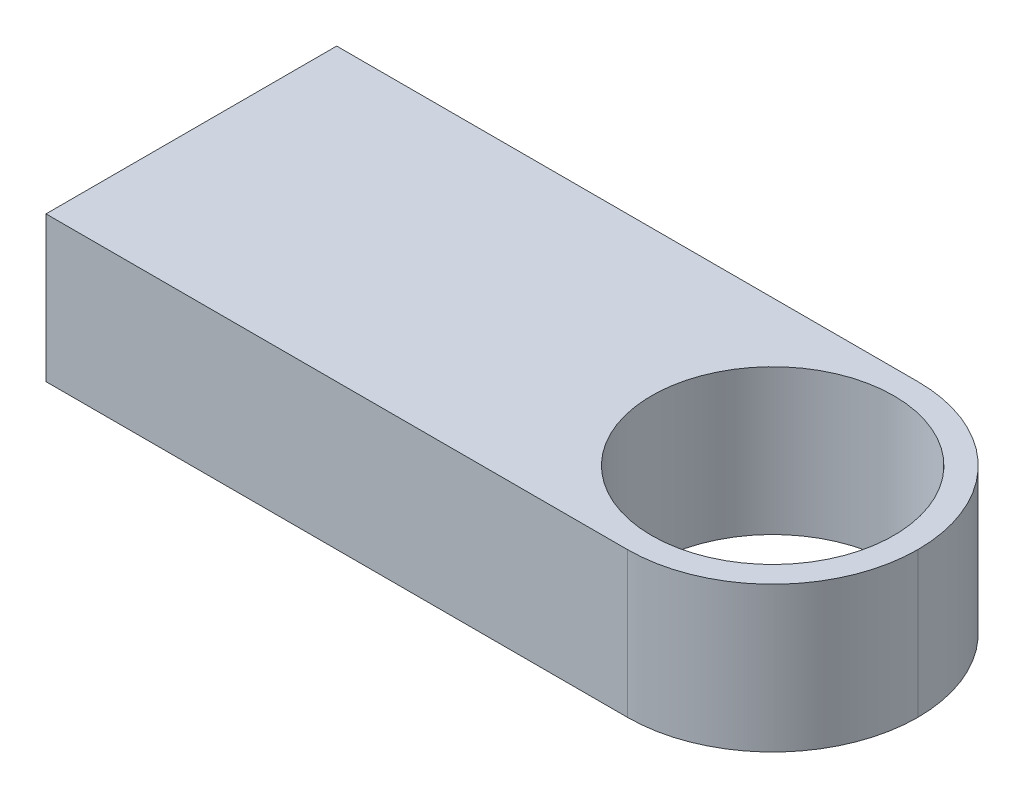
ISO-10303-21;
HEADER;
FILE_DESCRIPTION(('STEP AP214'),'2;1');
FILE_NAME('part.step','',(''),(''),'','','');
FILE_SCHEMA(('AUTOMOTIVE_DESIGN { 1 0 10303 214 1 1 1 1 }'));
ENDSEC;
DATA;
#1=APPLICATION_CONTEXT('core data for automotive mechanical design processes');
#2=APPLICATION_PROTOCOL_DEFINITION('international standard','automotive_design',2000,#1);
#3=PRODUCT_CONTEXT('',#1,'mechanical');
#4=PRODUCT('Part','Part','',(#3));
#5=PRODUCT_RELATED_PRODUCT_CATEGORY('part','',(#4));
#6=PRODUCT_DEFINITION_FORMATION('','',#4);
#7=PRODUCT_DEFINITION_CONTEXT('part definition',#1,'design');
#8=PRODUCT_DEFINITION('design','',#6,#7);
#9=PRODUCT_DEFINITION_SHAPE('','',#8);
#10=(LENGTH_UNIT() NAMED_UNIT(*) SI_UNIT(.MILLI.,.METRE.));
#11=(NAMED_UNIT(*) PLANE_ANGLE_UNIT() SI_UNIT($,.RADIAN.));
#12=(NAMED_UNIT(*) SI_UNIT($,.STERADIAN.) SOLID_ANGLE_UNIT());
#13=UNCERTAINTY_MEASURE_WITH_UNIT(LENGTH_MEASURE(1.E-05),#10,'distance_accuracy_value','');
#14=(GEOMETRIC_REPRESENTATION_CONTEXT(3) GLOBAL_UNCERTAINTY_ASSIGNED_CONTEXT((#13)) GLOBAL_UNIT_ASSIGNED_CONTEXT((#10,
#11,#12)) REPRESENTATION_CONTEXT('',''));
#15=CARTESIAN_POINT('',(0.,0.,0.));
#16=DIRECTION('',(0.,0.,1.));
#17=DIRECTION('',(1.,0.,0.));
#18=AXIS2_PLACEMENT_3D('',#15,#16,#17);
#19=CARTESIAN_POINT('',(150.,15.,-30.));
#20=DIRECTION('',(0.,0.,1.));
#21=DIRECTION('',(0.,-1.,0.));
#22=AXIS2_PLACEMENT_3D('',#19,#20,#21);
#23=PLANE('',#22);
#24=DIRECTION('',(-1.,0.,0.));
#25=VECTOR('',#24,1.);
#26=CARTESIAN_POINT('',(150.,15.,-30.));
#27=LINE('',#26,#25);
#28=CARTESIAN_POINT('',(120.,15.,-30.));
#29=VERTEX_POINT('',#28);
#30=CARTESIAN_POINT('',(0.,15.,-30.));
#31=VERTEX_POINT('',#30);
#32=EDGE_CURVE('E80',#29,#31,#27,.T.);
#33=ORIENTED_EDGE('',*,*,#32,.F.);
#34=DIRECTION('',(0.,1.,0.));
#35=VECTOR('',#34,1.);
#36=CARTESIAN_POINT('',(120.,-15.,-30.));
#37=LINE('',#36,#35);
#38=CARTESIAN_POINT('',(120.,-15.,-30.));
#39=VERTEX_POINT('',#38);
#40=EDGE_CURVE('E121',#29,#39,#37,.F.);
#41=ORIENTED_EDGE('',*,*,#40,.T.);
#42=DIRECTION('',(-1.,0.,0.));
#43=VECTOR('',#42,1.);
#44=CARTESIAN_POINT('',(150.,-15.,-30.));
#45=LINE('',#44,#43);
#46=CARTESIAN_POINT('',(0.,-15.,-30.));
#47=VERTEX_POINT('',#46);
#48=EDGE_CURVE('E103',#39,#47,#45,.T.);
#49=ORIENTED_EDGE('',*,*,#48,.T.);
#50=DIRECTION('',(0.,1.,0.));
#51=VECTOR('',#50,1.);
#52=CARTESIAN_POINT('',(0.,15.,-30.));
#53=LINE('',#52,#51);
#54=EDGE_CURVE('E99',#47,#31,#53,.T.);
#55=ORIENTED_EDGE('',*,*,#54,.T.);
#56=EDGE_LOOP('',(#33,#41,#49,#55));
#57=FACE_BOUND('',#56,.T.);
#58=ADVANCED_FACE('F36',(#57),#23,.F.);
#59=CARTESIAN_POINT('',(150.,15.,30.));
#60=DIRECTION('',(0.,-1.,0.));
#61=DIRECTION('',(0.,0.,-1.));
#62=AXIS2_PLACEMENT_3D('',#59,#60,#61);
#63=PLANE('',#62);
#64=CARTESIAN_POINT('',(120.,15.,0.));
#65=DIRECTION('',(0.,1.,0.));
#66=DIRECTION('',(0.,0.,1.));
#67=AXIS2_PLACEMENT_3D('',#64,#65,#66);
#68=CIRCLE('',#67,25.);
#69=CARTESIAN_POINT('',(120.,15.,25.));
#70=VERTEX_POINT('',#69);
#71=EDGE_CURVE('E108',#70,#70,#68,.T.);
#72=ORIENTED_EDGE('',*,*,#71,.F.);
#73=EDGE_LOOP('',(#72));
#74=FACE_BOUND('',#73,.T.);
#75=CARTESIAN_POINT('',(120.,15.,0.));
#76=DIRECTION('',(0.,-1.,0.));
#77=DIRECTION('',(0.,0.,-1.));
#78=AXIS2_PLACEMENT_3D('',#75,#76,#77);
#79=CIRCLE('',#78,30.);
#80=CARTESIAN_POINT('',(120.,15.,30.));
#81=VERTEX_POINT('',#80);
#82=CARTESIAN_POINT('',(150.,15.,0.));
#83=VERTEX_POINT('',#82);
#84=EDGE_CURVE('E92',#81,#83,#79,.F.);
#85=ORIENTED_EDGE('',*,*,#84,.T.);
#86=CARTESIAN_POINT('',(120.,15.,0.));
#87=DIRECTION('',(0.,-1.,0.));
#88=DIRECTION('',(0.,0.,-1.));
#89=AXIS2_PLACEMENT_3D('',#86,#87,#88);
#90=CIRCLE('',#89,30.);
#91=EDGE_CURVE('E87',#83,#29,#90,.F.);
#92=ORIENTED_EDGE('',*,*,#91,.T.);
#93=ORIENTED_EDGE('',*,*,#32,.T.);
#94=DIRECTION('',(0.,0.,1.));
#95=VECTOR('',#94,1.);
#96=CARTESIAN_POINT('',(0.,15.,30.));
#97=LINE('',#96,#95);
#98=CARTESIAN_POINT('',(0.,15.,30.));
#99=VERTEX_POINT('',#98);
#100=EDGE_CURVE('E84',#31,#99,#97,.T.);
#101=ORIENTED_EDGE('',*,*,#100,.T.);
#102=DIRECTION('',(-1.,0.,0.));
#103=VECTOR('',#102,1.);
#104=CARTESIAN_POINT('',(150.,15.,30.));
#105=LINE('',#104,#103);
#106=EDGE_CURVE('E93',#81,#99,#105,.T.);
#107=ORIENTED_EDGE('',*,*,#106,.F.);
#108=EDGE_LOOP('',(#85,#92,#93,#101,#107));
#109=FACE_BOUND('',#108,.T.);
#110=ADVANCED_FACE('F82',(#74,#109),#63,.F.);
#111=CARTESIAN_POINT('',(150.,15.,30.));
#112=DIRECTION('',(0.,0.,-1.));
#113=DIRECTION('',(0.,1.,0.));
#114=AXIS2_PLACEMENT_3D('',#111,#112,#113);
#115=PLANE('',#114);
#116=DIRECTION('',(-1.,0.,0.));
#117=VECTOR('',#116,1.);
#118=CARTESIAN_POINT('',(150.,-15.,30.));
#119=LINE('',#118,#117);
#120=CARTESIAN_POINT('',(120.,-15.,30.));
#121=VERTEX_POINT('',#120);
#122=CARTESIAN_POINT('',(0.,-15.,30.));
#123=VERTEX_POINT('',#122);
#124=EDGE_CURVE('E116',#121,#123,#119,.T.);
#125=ORIENTED_EDGE('',*,*,#124,.F.);
#126=DIRECTION('',(0.,-1.,0.));
#127=VECTOR('',#126,1.);
#128=CARTESIAN_POINT('',(120.,15.,30.));
#129=LINE('',#128,#127);
#130=EDGE_CURVE('E11',#121,#81,#129,.F.);
#131=ORIENTED_EDGE('',*,*,#130,.T.);
#132=ORIENTED_EDGE('',*,*,#106,.T.);
#133=DIRECTION('',(0.,-1.,0.));
#134=VECTOR('',#133,1.);
#135=CARTESIAN_POINT('',(0.,15.,30.));
#136=LINE('',#135,#134);
#137=EDGE_CURVE('E101',#99,#123,#136,.T.);
#138=ORIENTED_EDGE('',*,*,#137,.T.);
#139=EDGE_LOOP('',(#125,#131,#132,#138));
#140=FACE_BOUND('',#139,.T.);
#141=ADVANCED_FACE('F128',(#140),#115,.F.);
#142=CARTESIAN_POINT('',(150.,-15.,30.));
#143=DIRECTION('',(0.,1.,0.));
#144=DIRECTION('',(0.,0.,1.));
#145=AXIS2_PLACEMENT_3D('',#142,#143,#144);
#146=PLANE('',#145);
#147=CARTESIAN_POINT('',(120.,-15.,0.));
#148=DIRECTION('',(0.,1.,0.));
#149=DIRECTION('',(0.,0.,1.));
#150=AXIS2_PLACEMENT_3D('',#147,#148,#149);
#151=CIRCLE('',#150,25.);
#152=CARTESIAN_POINT('',(120.,-15.,25.));
#153=VERTEX_POINT('',#152);
#154=EDGE_CURVE('E105',#153,#153,#151,.F.);
#155=ORIENTED_EDGE('',*,*,#154,.F.);
#156=EDGE_LOOP('',(#155));
#157=FACE_BOUND('',#156,.T.);
#158=ORIENTED_EDGE('',*,*,#48,.F.);
#159=CARTESIAN_POINT('',(120.,-15.,0.));
#160=DIRECTION('',(0.,1.,0.));
#161=DIRECTION('',(0.,0.,1.));
#162=AXIS2_PLACEMENT_3D('',#159,#160,#161);
#163=CIRCLE('',#162,30.);
#164=CARTESIAN_POINT('',(150.,-15.,0.));
#165=VERTEX_POINT('',#164);
#166=EDGE_CURVE('E45',#39,#165,#163,.F.);
#167=ORIENTED_EDGE('',*,*,#166,.T.);
#168=CARTESIAN_POINT('',(120.,-15.,0.));
#169=DIRECTION('',(0.,1.,0.));
#170=DIRECTION('',(0.,0.,1.));
#171=AXIS2_PLACEMENT_3D('',#168,#169,#170);
#172=CIRCLE('',#171,30.);
#173=EDGE_CURVE('E52',#165,#121,#172,.F.);
#174=ORIENTED_EDGE('',*,*,#173,.T.);
#175=ORIENTED_EDGE('',*,*,#124,.T.);
#176=DIRECTION('',(0.,0.,-1.));
#177=VECTOR('',#176,1.);
#178=CARTESIAN_POINT('',(0.,-15.,30.));
#179=LINE('',#178,#177);
#180=EDGE_CURVE('E113',#123,#47,#179,.T.);
#181=ORIENTED_EDGE('',*,*,#180,.T.);
#182=EDGE_LOOP('',(#158,#167,#174,#175,#181));
#183=FACE_BOUND('',#182,.T.);
#184=ADVANCED_FACE('F125',(#157,#183),#146,.F.);
#185=CARTESIAN_POINT('',(0.,0.,0.));
#186=DIRECTION('',(1.,0.,0.));
#187=DIRECTION('',(0.,0.,-1.));
#188=AXIS2_PLACEMENT_3D('',#185,#186,#187);
#189=PLANE('',#188);
#190=ORIENTED_EDGE('',*,*,#54,.F.);
#191=ORIENTED_EDGE('',*,*,#180,.F.);
#192=ORIENTED_EDGE('',*,*,#137,.F.);
#193=ORIENTED_EDGE('',*,*,#100,.F.);
#194=EDGE_LOOP('',(#190,#191,#192,#193));
#195=FACE_BOUND('',#194,.T.);
#196=ADVANCED_FACE('F97',(#195),#189,.F.);
#197=CARTESIAN_POINT('',(120.,-85.7106781186548,0.));
#198=DIRECTION('',(0.,1.,0.));
#199=DIRECTION('',(0.,0.,1.));
#200=AXIS2_PLACEMENT_3D('',#197,#198,#199);
#201=CYLINDRICAL_SURFACE('',#200,25.);
#202=ORIENTED_EDGE('',*,*,#154,.T.);
#203=EDGE_LOOP('',(#202));
#204=FACE_BOUND('',#203,.T.);
#205=ORIENTED_EDGE('',*,*,#71,.T.);
#206=EDGE_LOOP('',(#205));
#207=FACE_BOUND('',#206,.T.);
#208=ADVANCED_FACE('F139',(#204,#207),#201,.F.);
#209=CARTESIAN_POINT('',(120.,0.,0.));
#210=DIRECTION('',(0.,1.,0.));
#211=DIRECTION('',(0.,0.,1.));
#212=AXIS2_PLACEMENT_3D('',#209,#210,#211);
#213=CYLINDRICAL_SURFACE('',#212,30.);
#214=ORIENTED_EDGE('',*,*,#130,.F.);
#215=ORIENTED_EDGE('',*,*,#173,.F.);
#216=DIRECTION('',(0.,-1.,0.));
#217=VECTOR('',#216,1.);
#218=CARTESIAN_POINT('',(150.,-15.,0.));
#219=LINE('',#218,#217);
#220=EDGE_CURVE('E40',#83,#165,#219,.T.);
#221=ORIENTED_EDGE('',*,*,#220,.F.);
#222=ORIENTED_EDGE('',*,*,#84,.F.);
#223=EDGE_LOOP('',(#214,#215,#221,#222));
#224=FACE_BOUND('',#223,.T.);
#225=ADVANCED_FACE('F38',(#224),#213,.T.);
#226=CARTESIAN_POINT('',(120.,0.,0.));
#227=DIRECTION('',(0.,-1.,0.));
#228=DIRECTION('',(0.,0.,-1.));
#229=AXIS2_PLACEMENT_3D('',#226,#227,#228);
#230=CYLINDRICAL_SURFACE('',#229,30.);
#231=ORIENTED_EDGE('',*,*,#166,.F.);
#232=ORIENTED_EDGE('',*,*,#40,.F.);
#233=ORIENTED_EDGE('',*,*,#91,.F.);
#234=ORIENTED_EDGE('',*,*,#220,.T.);
#235=EDGE_LOOP('',(#231,#232,#233,#234));
#236=FACE_BOUND('',#235,.T.);
#237=ADVANCED_FACE('F133',(#236),#230,.T.);
#238=CLOSED_SHELL('',(#58,#110,#141,#184,#196,#208,#225,#237));
#239=MANIFOLD_SOLID_BREP('B2',#238);
#240=ADVANCED_BREP_SHAPE_REPRESENTATION('',(#18,#239),#14);
#241=SHAPE_DEFINITION_REPRESENTATION(#9,#240);
ENDSEC;
END-ISO-10303-21;
